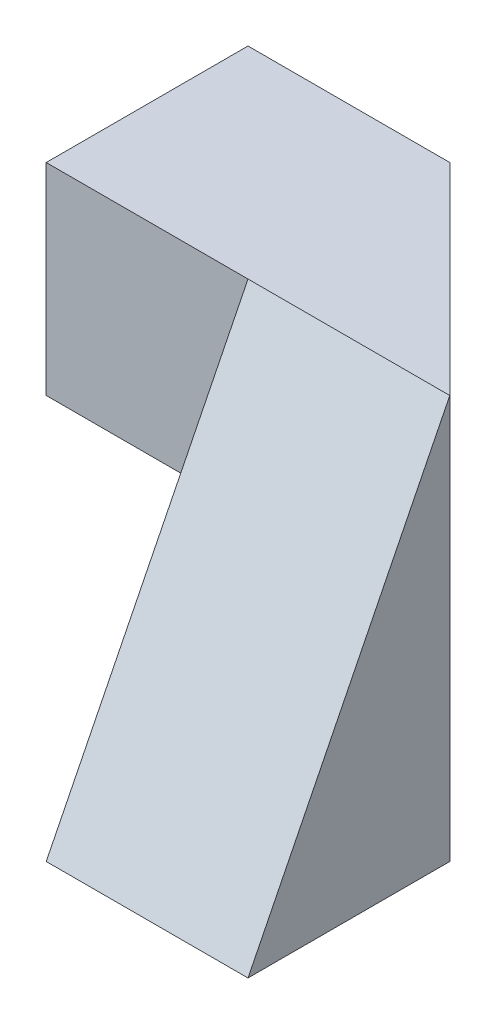
ISO-10303-21;
HEADER;
FILE_DESCRIPTION(('STEP AP214'),'2;1');
FILE_NAME('part.step','',(''),(''),'','','');
FILE_SCHEMA(('AUTOMOTIVE_DESIGN { 1 0 10303 214 1 1 1 1 }'));
ENDSEC;
DATA;
#1=APPLICATION_CONTEXT('core data for automotive mechanical design processes');
#2=APPLICATION_PROTOCOL_DEFINITION('international standard','automotive_design',2000,#1);
#3=PRODUCT_CONTEXT('',#1,'mechanical');
#4=PRODUCT('Part','Part','',(#3));
#5=PRODUCT_RELATED_PRODUCT_CATEGORY('part','',(#4));
#6=PRODUCT_DEFINITION_FORMATION('','',#4);
#7=PRODUCT_DEFINITION_CONTEXT('part definition',#1,'design');
#8=PRODUCT_DEFINITION('design','',#6,#7);
#9=PRODUCT_DEFINITION_SHAPE('','',#8);
#10=(LENGTH_UNIT() NAMED_UNIT(*) SI_UNIT(.MILLI.,.METRE.));
#11=(NAMED_UNIT(*) PLANE_ANGLE_UNIT() SI_UNIT($,.RADIAN.));
#12=(NAMED_UNIT(*) SI_UNIT($,.STERADIAN.) SOLID_ANGLE_UNIT());
#13=UNCERTAINTY_MEASURE_WITH_UNIT(LENGTH_MEASURE(1.E-05),#10,'distance_accuracy_value','');
#14=(GEOMETRIC_REPRESENTATION_CONTEXT(3) GLOBAL_UNCERTAINTY_ASSIGNED_CONTEXT((#13)) GLOBAL_UNIT_ASSIGNED_CONTEXT((#10,
#11,#12)) REPRESENTATION_CONTEXT('',''));
#15=CARTESIAN_POINT('',(0.,0.,0.));
#16=DIRECTION('',(0.,0.,1.));
#17=DIRECTION('',(1.,0.,0.));
#18=AXIS2_PLACEMENT_3D('',#15,#16,#17);
#19=CARTESIAN_POINT('',(0.,0.,40.));
#20=DIRECTION('',(1.,0.,0.));
#21=DIRECTION('',(0.,0.,-1.));
#22=AXIS2_PLACEMENT_3D('',#19,#20,#21);
#23=PLANE('',#22);
#24=DIRECTION('',(0.,0.,1.));
#25=VECTOR('',#24,1.);
#26=CARTESIAN_POINT('',(0.,20.,0.));
#27=LINE('',#26,#25);
#28=CARTESIAN_POINT('',(0.,20.,0.));
#29=VERTEX_POINT('',#28);
#30=CARTESIAN_POINT('',(0.,20.,20.));
#31=VERTEX_POINT('',#30);
#32=EDGE_CURVE('E118',#29,#31,#27,.T.);
#33=ORIENTED_EDGE('',*,*,#32,.T.);
#34=DIRECTION('',(0.,-1.,0.));
#35=VECTOR('',#34,1.);
#36=CARTESIAN_POINT('',(0.,40.,20.));
#37=LINE('',#36,#35);
#38=CARTESIAN_POINT('',(0.,40.,20.));
#39=VERTEX_POINT('',#38);
#40=EDGE_CURVE('E139',#39,#31,#37,.T.);
#41=ORIENTED_EDGE('',*,*,#40,.F.);
#42=DIRECTION('',(0.,0.,-1.));
#43=VECTOR('',#42,1.);
#44=CARTESIAN_POINT('',(0.,40.,40.));
#45=LINE('',#44,#43);
#46=CARTESIAN_POINT('',(0.,40.,0.));
#47=VERTEX_POINT('',#46);
#48=EDGE_CURVE('E110',#39,#47,#45,.T.);
#49=ORIENTED_EDGE('',*,*,#48,.T.);
#50=DIRECTION('',(0.,-1.,0.));
#51=VECTOR('',#50,1.);
#52=CARTESIAN_POINT('',(0.,0.,0.));
#53=LINE('',#52,#51);
#54=EDGE_CURVE('E115',#47,#29,#53,.T.);
#55=ORIENTED_EDGE('',*,*,#54,.T.);
#56=EDGE_LOOP('',(#33,#41,#49,#55));
#57=FACE_BOUND('',#56,.T.);
#58=ADVANCED_FACE('F33',(#57),#23,.F.);
#59=CARTESIAN_POINT('',(0.,0.,40.));
#60=DIRECTION('',(0.,1.,0.));
#61=DIRECTION('',(0.,0.,1.));
#62=AXIS2_PLACEMENT_3D('',#59,#60,#61);
#63=PLANE('',#62);
#64=DIRECTION('',(0.,0.,1.));
#65=VECTOR('',#64,1.);
#66=CARTESIAN_POINT('',(20.,0.,0.));
#67=LINE('',#66,#65);
#68=CARTESIAN_POINT('',(20.,0.,0.));
#69=VERTEX_POINT('',#68);
#70=CARTESIAN_POINT('',(20.,0.,40.));
#71=VERTEX_POINT('',#70);
#72=EDGE_CURVE('E106',#69,#71,#67,.T.);
#73=ORIENTED_EDGE('',*,*,#72,.F.);
#74=DIRECTION('',(0.707106781186548,0.,0.707106781186548));
#75=VECTOR('',#74,1.);
#76=CARTESIAN_POINT('',(20.,0.,0.));
#77=LINE('',#76,#75);
#78=CARTESIAN_POINT('',(40.,0.,20.));
#79=VERTEX_POINT('',#78);
#80=EDGE_CURVE('E91',#69,#79,#77,.T.);
#81=ORIENTED_EDGE('',*,*,#80,.T.);
#82=DIRECTION('',(0.,0.,-1.));
#83=VECTOR('',#82,1.);
#84=CARTESIAN_POINT('',(40.,0.,40.));
#85=LINE('',#84,#83);
#86=CARTESIAN_POINT('',(40.,0.,40.));
#87=VERTEX_POINT('',#86);
#88=EDGE_CURVE('E40',#87,#79,#85,.T.);
#89=ORIENTED_EDGE('',*,*,#88,.F.);
#90=DIRECTION('',(1.,0.,0.));
#91=VECTOR('',#90,1.);
#92=CARTESIAN_POINT('',(0.,0.,40.));
#93=LINE('',#92,#91);
#94=EDGE_CURVE('E111',#71,#87,#93,.T.);
#95=ORIENTED_EDGE('',*,*,#94,.F.);
#96=EDGE_LOOP('',(#73,#81,#89,#95));
#97=FACE_BOUND('',#96,.T.);
#98=ADVANCED_FACE('F104',(#97),#63,.F.);
#99=CARTESIAN_POINT('',(40.,0.,40.));
#100=DIRECTION('',(-1.,0.,0.));
#101=DIRECTION('',(0.,0.,1.));
#102=AXIS2_PLACEMENT_3D('',#99,#100,#101);
#103=PLANE('',#102);
#104=ORIENTED_EDGE('',*,*,#88,.T.);
#105=DIRECTION('',(0.,1.,0.));
#106=VECTOR('',#105,1.);
#107=CARTESIAN_POINT('',(40.,0.,20.));
#108=LINE('',#107,#106);
#109=CARTESIAN_POINT('',(40.,40.,20.));
#110=VERTEX_POINT('',#109);
#111=EDGE_CURVE('E88',#79,#110,#108,.T.);
#112=ORIENTED_EDGE('',*,*,#111,.T.);
#113=DIRECTION('',(0.,-0.894427190999916,0.447213595499958));
#114=VECTOR('',#113,1.);
#115=CARTESIAN_POINT('',(40.,40.,20.));
#116=LINE('',#115,#114);
#117=EDGE_CURVE('E109',#110,#87,#116,.T.);
#118=ORIENTED_EDGE('',*,*,#117,.T.);
#119=EDGE_LOOP('',(#104,#112,#118));
#120=FACE_BOUND('',#119,.T.);
#121=ADVANCED_FACE('F108',(#120),#103,.F.);
#122=CARTESIAN_POINT('',(0.,40.,40.));
#123=DIRECTION('',(0.,-1.,0.));
#124=DIRECTION('',(0.,0.,-1.));
#125=AXIS2_PLACEMENT_3D('',#122,#123,#124);
#126=PLANE('',#125);
#127=DIRECTION('',(-1.,0.,0.));
#128=VECTOR('',#127,1.);
#129=CARTESIAN_POINT('',(40.,40.,20.));
#130=LINE('',#129,#128);
#131=CARTESIAN_POINT('',(20.,40.,20.));
#132=VERTEX_POINT('',#131);
#133=EDGE_CURVE('E131',#110,#132,#130,.T.);
#134=ORIENTED_EDGE('',*,*,#133,.F.);
#135=DIRECTION('',(0.707106781186548,0.,0.707106781186548));
#136=VECTOR('',#135,1.);
#137=CARTESIAN_POINT('',(20.,40.,0.));
#138=LINE('',#137,#136);
#139=CARTESIAN_POINT('',(20.,40.,0.));
#140=VERTEX_POINT('',#139);
#141=EDGE_CURVE('E93',#140,#110,#138,.T.);
#142=ORIENTED_EDGE('',*,*,#141,.F.);
#143=DIRECTION('',(-1.,0.,0.));
#144=VECTOR('',#143,1.);
#145=CARTESIAN_POINT('',(0.,40.,0.));
#146=LINE('',#145,#144);
#147=EDGE_CURVE('E53',#140,#47,#146,.T.);
#148=ORIENTED_EDGE('',*,*,#147,.T.);
#149=ORIENTED_EDGE('',*,*,#48,.F.);
#150=DIRECTION('',(1.,0.,0.));
#151=VECTOR('',#150,1.);
#152=CARTESIAN_POINT('',(20.,40.,20.));
#153=LINE('',#152,#151);
#154=EDGE_CURVE('E98',#39,#132,#153,.T.);
#155=ORIENTED_EDGE('',*,*,#154,.T.);
#156=EDGE_LOOP('',(#134,#142,#148,#149,#155));
#157=FACE_BOUND('',#156,.T.);
#158=ADVANCED_FACE('F149',(#157),#126,.F.);
#159=CARTESIAN_POINT('',(0.,0.,0.));
#160=DIRECTION('',(0.,0.,-1.));
#161=DIRECTION('',(-1.,0.,0.));
#162=AXIS2_PLACEMENT_3D('',#159,#160,#161);
#163=PLANE('',#162);
#164=DIRECTION('',(0.,1.,0.));
#165=VECTOR('',#164,1.);
#166=CARTESIAN_POINT('',(20.,0.,0.));
#167=LINE('',#166,#165);
#168=CARTESIAN_POINT('',(20.,20.,0.));
#169=VERTEX_POINT('',#168);
#170=EDGE_CURVE('E99',#169,#140,#167,.T.);
#171=ORIENTED_EDGE('',*,*,#170,.F.);
#172=DIRECTION('',(-1.,0.,0.));
#173=VECTOR('',#172,1.);
#174=CARTESIAN_POINT('',(0.,20.,0.));
#175=LINE('',#174,#173);
#176=EDGE_CURVE('E122',#169,#29,#175,.T.);
#177=ORIENTED_EDGE('',*,*,#176,.T.);
#178=ORIENTED_EDGE('',*,*,#54,.F.);
#179=ORIENTED_EDGE('',*,*,#147,.F.);
#180=EDGE_LOOP('',(#171,#177,#178,#179));
#181=FACE_BOUND('',#180,.T.);
#182=ADVANCED_FACE('F151',(#181),#163,.T.);
#183=CARTESIAN_POINT('',(0.,20.,0.));
#184=DIRECTION('',(0.,1.,0.));
#185=DIRECTION('',(0.,0.,1.));
#186=AXIS2_PLACEMENT_3D('',#183,#184,#185);
#187=PLANE('',#186);
#188=DIRECTION('',(0.,0.,1.));
#189=VECTOR('',#188,1.);
#190=CARTESIAN_POINT('',(20.,20.,0.));
#191=LINE('',#190,#189);
#192=CARTESIAN_POINT('',(20.,20.,20.));
#193=VERTEX_POINT('',#192);
#194=EDGE_CURVE('E121',#169,#193,#191,.T.);
#195=ORIENTED_EDGE('',*,*,#194,.T.);
#196=DIRECTION('',(-1.,0.,0.));
#197=VECTOR('',#196,1.);
#198=CARTESIAN_POINT('',(0.,20.,20.));
#199=LINE('',#198,#197);
#200=EDGE_CURVE('E135',#193,#31,#199,.T.);
#201=ORIENTED_EDGE('',*,*,#200,.T.);
#202=ORIENTED_EDGE('',*,*,#32,.F.);
#203=ORIENTED_EDGE('',*,*,#176,.F.);
#204=EDGE_LOOP('',(#195,#201,#202,#203));
#205=FACE_BOUND('',#204,.T.);
#206=ADVANCED_FACE('F166',(#205),#187,.F.);
#207=CARTESIAN_POINT('',(20.,0.,0.));
#208=DIRECTION('',(1.,0.,0.));
#209=DIRECTION('',(0.,0.,-1.));
#210=AXIS2_PLACEMENT_3D('',#207,#208,#209);
#211=PLANE('',#210);
#212=ORIENTED_EDGE('',*,*,#72,.T.);
#213=DIRECTION('',(0.,0.894427190999916,-0.447213595499958));
#214=VECTOR('',#213,1.);
#215=CARTESIAN_POINT('',(20.,16.,32.));
#216=LINE('',#215,#214);
#217=EDGE_CURVE('E11',#71,#132,#216,.T.);
#218=ORIENTED_EDGE('',*,*,#217,.T.);
#219=DIRECTION('',(0.,-1.,0.));
#220=VECTOR('',#219,1.);
#221=CARTESIAN_POINT('',(20.,40.,20.));
#222=LINE('',#221,#220);
#223=EDGE_CURVE('E138',#132,#193,#222,.T.);
#224=ORIENTED_EDGE('',*,*,#223,.T.);
#225=ORIENTED_EDGE('',*,*,#194,.F.);
#226=DIRECTION('',(0.,1.,0.));
#227=VECTOR('',#226,1.);
#228=CARTESIAN_POINT('',(20.,0.,0.));
#229=LINE('',#228,#227);
#230=EDGE_CURVE('E129',#69,#169,#229,.T.);
#231=ORIENTED_EDGE('',*,*,#230,.F.);
#232=EDGE_LOOP('',(#212,#218,#224,#225,#231));
#233=FACE_BOUND('',#232,.T.);
#234=ADVANCED_FACE('F159',(#233),#211,.F.);
#235=CARTESIAN_POINT('',(40.,40.,20.));
#236=DIRECTION('',(0.,-0.447213595499958,-0.894427190999916));
#237=DIRECTION('',(0.,0.894427190999916,-0.447213595499958));
#238=AXIS2_PLACEMENT_3D('',#235,#236,#237);
#239=PLANE('',#238);
#240=ORIENTED_EDGE('',*,*,#133,.T.);
#241=ORIENTED_EDGE('',*,*,#217,.F.);
#242=ORIENTED_EDGE('',*,*,#94,.T.);
#243=ORIENTED_EDGE('',*,*,#117,.F.);
#244=EDGE_LOOP('',(#240,#241,#242,#243));
#245=FACE_BOUND('',#244,.T.);
#246=ADVANCED_FACE('F156',(#245),#239,.F.);
#247=CARTESIAN_POINT('',(20.,40.,20.));
#248=DIRECTION('',(0.,0.,-1.));
#249=DIRECTION('',(-1.,0.,0.));
#250=AXIS2_PLACEMENT_3D('',#247,#248,#249);
#251=PLANE('',#250);
#252=ORIENTED_EDGE('',*,*,#223,.F.);
#253=ORIENTED_EDGE('',*,*,#154,.F.);
#254=ORIENTED_EDGE('',*,*,#40,.T.);
#255=ORIENTED_EDGE('',*,*,#200,.F.);
#256=EDGE_LOOP('',(#252,#253,#254,#255));
#257=FACE_BOUND('',#256,.T.);
#258=ADVANCED_FACE('F158',(#257),#251,.F.);
#259=CARTESIAN_POINT('',(20.,0.,0.));
#260=DIRECTION('',(-0.707106781186548,0.,0.707106781186548));
#261=DIRECTION('',(0.707106781186548,0.,0.707106781186548));
#262=AXIS2_PLACEMENT_3D('',#259,#260,#261);
#263=PLANE('',#262);
#264=ORIENTED_EDGE('',*,*,#141,.T.);
#265=ORIENTED_EDGE('',*,*,#111,.F.);
#266=ORIENTED_EDGE('',*,*,#80,.F.);
#267=ORIENTED_EDGE('',*,*,#230,.T.);
#268=ORIENTED_EDGE('',*,*,#170,.T.);
#269=EDGE_LOOP('',(#264,#265,#266,#267,#268));
#270=FACE_BOUND('',#269,.T.);
#271=ADVANCED_FACE('F90',(#270),#263,.F.);
#272=CLOSED_SHELL('',(#58,#98,#121,#158,#182,#206,#234,#246,#258,#271));
#273=MANIFOLD_SOLID_BREP('B2',#272);
#274=ADVANCED_BREP_SHAPE_REPRESENTATION('',(#18,#273),#14);
#275=SHAPE_DEFINITION_REPRESENTATION(#9,#274);
ENDSEC;
END-ISO-10303-21;
